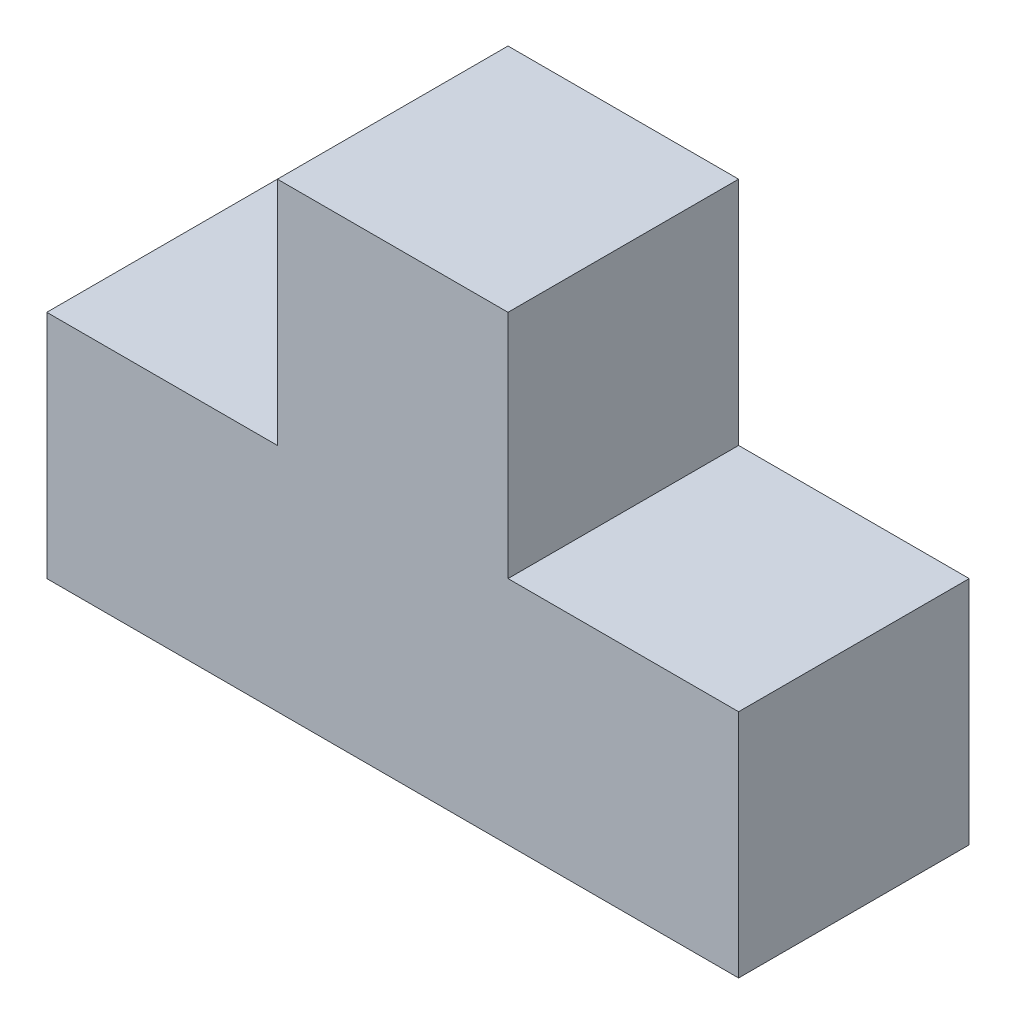
ISO-10303-21;
HEADER;
FILE_DESCRIPTION(('STEP AP214'),'2;1');
FILE_NAME('part.step','',(''),(''),'','','');
FILE_SCHEMA(('AUTOMOTIVE_DESIGN { 1 0 10303 214 1 1 1 1 }'));
ENDSEC;
DATA;
#1=APPLICATION_CONTEXT('core data for automotive mechanical design processes');
#2=APPLICATION_PROTOCOL_DEFINITION('international standard','automotive_design',2000,#1);
#3=PRODUCT_CONTEXT('',#1,'mechanical');
#4=PRODUCT('Part','Part','',(#3));
#5=PRODUCT_RELATED_PRODUCT_CATEGORY('part','',(#4));
#6=PRODUCT_DEFINITION_FORMATION('','',#4);
#7=PRODUCT_DEFINITION_CONTEXT('part definition',#1,'design');
#8=PRODUCT_DEFINITION('design','',#6,#7);
#9=PRODUCT_DEFINITION_SHAPE('','',#8);
#10=(LENGTH_UNIT() NAMED_UNIT(*) SI_UNIT(.MILLI.,.METRE.));
#11=(NAMED_UNIT(*) PLANE_ANGLE_UNIT() SI_UNIT($,.RADIAN.));
#12=(NAMED_UNIT(*) SI_UNIT($,.STERADIAN.) SOLID_ANGLE_UNIT());
#13=UNCERTAINTY_MEASURE_WITH_UNIT(LENGTH_MEASURE(1.E-05),#10,'distance_accuracy_value','');
#14=(GEOMETRIC_REPRESENTATION_CONTEXT(3) GLOBAL_UNCERTAINTY_ASSIGNED_CONTEXT((#13)) GLOBAL_UNIT_ASSIGNED_CONTEXT((#10,
#11,#12)) REPRESENTATION_CONTEXT('',''));
#15=CARTESIAN_POINT('',(0.,0.,0.));
#16=DIRECTION('',(0.,0.,1.));
#17=DIRECTION('',(1.,0.,0.));
#18=AXIS2_PLACEMENT_3D('',#15,#16,#17);
#19=CARTESIAN_POINT('',(45.,30.,-30.));
#20=DIRECTION('',(0.,1.,0.));
#21=DIRECTION('',(-1.,0.,0.));
#22=AXIS2_PLACEMENT_3D('',#19,#20,#21);
#23=PLANE('',#22);
#24=DIRECTION('',(-1.,0.,0.));
#25=VECTOR('',#24,1.);
#26=CARTESIAN_POINT('',(45.,30.,0.));
#27=LINE('',#26,#25);
#28=CARTESIAN_POINT('',(45.,30.,0.));
#29=VERTEX_POINT('',#28);
#30=CARTESIAN_POINT('',(15.,30.,0.));
#31=VERTEX_POINT('',#30);
#32=EDGE_CURVE('E130',#29,#31,#27,.T.);
#33=ORIENTED_EDGE('',*,*,#32,.F.);
#34=DIRECTION('',(0.,0.,1.));
#35=VECTOR('',#34,1.);
#36=CARTESIAN_POINT('',(45.,30.,-30.));
#37=LINE('',#36,#35);
#38=CARTESIAN_POINT('',(45.,30.,-30.));
#39=VERTEX_POINT('',#38);
#40=EDGE_CURVE('E11',#39,#29,#37,.T.);
#41=ORIENTED_EDGE('',*,*,#40,.F.);
#42=DIRECTION('',(-1.,0.,0.));
#43=VECTOR('',#42,1.);
#44=CARTESIAN_POINT('',(45.,30.,-30.));
#45=LINE('',#44,#43);
#46=CARTESIAN_POINT('',(15.,30.,-30.));
#47=VERTEX_POINT('',#46);
#48=EDGE_CURVE('E150',#39,#47,#45,.T.);
#49=ORIENTED_EDGE('',*,*,#48,.T.);
#50=DIRECTION('',(0.,0.,1.));
#51=VECTOR('',#50,1.);
#52=CARTESIAN_POINT('',(15.,30.,-30.));
#53=LINE('',#52,#51);
#54=EDGE_CURVE('E36',#47,#31,#53,.T.);
#55=ORIENTED_EDGE('',*,*,#54,.T.);
#56=EDGE_LOOP('',(#33,#41,#49,#55));
#57=FACE_BOUND('',#56,.T.);
#58=ADVANCED_FACE('F33',(#57),#23,.T.);
#59=CARTESIAN_POINT('',(45.,0.,-30.));
#60=DIRECTION('',(1.,0.,0.));
#61=DIRECTION('',(0.,1.,0.));
#62=AXIS2_PLACEMENT_3D('',#59,#60,#61);
#63=PLANE('',#62);
#64=DIRECTION('',(0.,1.,0.));
#65=VECTOR('',#64,1.);
#66=CARTESIAN_POINT('',(45.,0.,0.));
#67=LINE('',#66,#65);
#68=CARTESIAN_POINT('',(45.,0.,0.));
#69=VERTEX_POINT('',#68);
#70=EDGE_CURVE('E148',#69,#29,#67,.T.);
#71=ORIENTED_EDGE('',*,*,#70,.F.);
#72=DIRECTION('',(0.,0.,1.));
#73=VECTOR('',#72,1.);
#74=CARTESIAN_POINT('',(45.,0.,-30.));
#75=LINE('',#74,#73);
#76=CARTESIAN_POINT('',(45.,0.,-30.));
#77=VERTEX_POINT('',#76);
#78=EDGE_CURVE('E42',#77,#69,#75,.T.);
#79=ORIENTED_EDGE('',*,*,#78,.F.);
#80=DIRECTION('',(0.,1.,0.));
#81=VECTOR('',#80,1.);
#82=CARTESIAN_POINT('',(45.,0.,-30.));
#83=LINE('',#82,#81);
#84=EDGE_CURVE('E120',#77,#39,#83,.T.);
#85=ORIENTED_EDGE('',*,*,#84,.T.);
#86=ORIENTED_EDGE('',*,*,#40,.T.);
#87=EDGE_LOOP('',(#71,#79,#85,#86));
#88=FACE_BOUND('',#87,.T.);
#89=ADVANCED_FACE('F162',(#88),#63,.T.);
#90=CARTESIAN_POINT('',(-45.,0.,-30.));
#91=DIRECTION('',(0.,-1.,0.));
#92=DIRECTION('',(1.,0.,0.));
#93=AXIS2_PLACEMENT_3D('',#90,#91,#92);
#94=PLANE('',#93);
#95=DIRECTION('',(1.,0.,0.));
#96=VECTOR('',#95,1.);
#97=CARTESIAN_POINT('',(-45.,0.,0.));
#98=LINE('',#97,#96);
#99=CARTESIAN_POINT('',(-45.,0.,0.));
#100=VERTEX_POINT('',#99);
#101=EDGE_CURVE('E107',#100,#69,#98,.T.);
#102=ORIENTED_EDGE('',*,*,#101,.F.);
#103=DIRECTION('',(0.,0.,1.));
#104=VECTOR('',#103,1.);
#105=CARTESIAN_POINT('',(-45.,0.,-30.));
#106=LINE('',#105,#104);
#107=CARTESIAN_POINT('',(-45.,0.,-30.));
#108=VERTEX_POINT('',#107);
#109=EDGE_CURVE('E102',#108,#100,#106,.T.);
#110=ORIENTED_EDGE('',*,*,#109,.F.);
#111=DIRECTION('',(1.,0.,0.));
#112=VECTOR('',#111,1.);
#113=CARTESIAN_POINT('',(-45.,0.,-30.));
#114=LINE('',#113,#112);
#115=EDGE_CURVE('E105',#108,#77,#114,.T.);
#116=ORIENTED_EDGE('',*,*,#115,.T.);
#117=ORIENTED_EDGE('',*,*,#78,.T.);
#118=EDGE_LOOP('',(#102,#110,#116,#117));
#119=FACE_BOUND('',#118,.T.);
#120=ADVANCED_FACE('F104',(#119),#94,.T.);
#121=CARTESIAN_POINT('',(-45.,30.,-30.));
#122=DIRECTION('',(-1.,0.,0.));
#123=DIRECTION('',(0.,-1.,0.));
#124=AXIS2_PLACEMENT_3D('',#121,#122,#123);
#125=PLANE('',#124);
#126=DIRECTION('',(0.,-1.,0.));
#127=VECTOR('',#126,1.);
#128=CARTESIAN_POINT('',(-45.,30.,0.));
#129=LINE('',#128,#127);
#130=CARTESIAN_POINT('',(-45.,30.,0.));
#131=VERTEX_POINT('',#130);
#132=EDGE_CURVE('E145',#131,#100,#129,.T.);
#133=ORIENTED_EDGE('',*,*,#132,.F.);
#134=DIRECTION('',(0.,0.,1.));
#135=VECTOR('',#134,1.);
#136=CARTESIAN_POINT('',(-45.,30.,-30.));
#137=LINE('',#136,#135);
#138=CARTESIAN_POINT('',(-45.,30.,-30.));
#139=VERTEX_POINT('',#138);
#140=EDGE_CURVE('E112',#139,#131,#137,.T.);
#141=ORIENTED_EDGE('',*,*,#140,.F.);
#142=DIRECTION('',(0.,-1.,0.));
#143=VECTOR('',#142,1.);
#144=CARTESIAN_POINT('',(-45.,30.,-30.));
#145=LINE('',#144,#143);
#146=EDGE_CURVE('E118',#139,#108,#145,.T.);
#147=ORIENTED_EDGE('',*,*,#146,.T.);
#148=ORIENTED_EDGE('',*,*,#109,.T.);
#149=EDGE_LOOP('',(#133,#141,#147,#148));
#150=FACE_BOUND('',#149,.T.);
#151=ADVANCED_FACE('F122',(#150),#125,.T.);
#152=CARTESIAN_POINT('',(-15.,30.,-30.));
#153=DIRECTION('',(0.,1.,0.));
#154=DIRECTION('',(-1.,0.,0.));
#155=AXIS2_PLACEMENT_3D('',#152,#153,#154);
#156=PLANE('',#155);
#157=DIRECTION('',(-1.,0.,0.));
#158=VECTOR('',#157,1.);
#159=CARTESIAN_POINT('',(-15.,30.,0.));
#160=LINE('',#159,#158);
#161=CARTESIAN_POINT('',(-15.,30.,0.));
#162=VERTEX_POINT('',#161);
#163=EDGE_CURVE('E142',#162,#131,#160,.T.);
#164=ORIENTED_EDGE('',*,*,#163,.F.);
#165=DIRECTION('',(0.,0.,1.));
#166=VECTOR('',#165,1.);
#167=CARTESIAN_POINT('',(-15.,30.,-30.));
#168=LINE('',#167,#166);
#169=CARTESIAN_POINT('',(-15.,30.,-30.));
#170=VERTEX_POINT('',#169);
#171=EDGE_CURVE('E154',#170,#162,#168,.T.);
#172=ORIENTED_EDGE('',*,*,#171,.F.);
#173=DIRECTION('',(-1.,0.,0.));
#174=VECTOR('',#173,1.);
#175=CARTESIAN_POINT('',(-15.,30.,-30.));
#176=LINE('',#175,#174);
#177=EDGE_CURVE('E123',#170,#139,#176,.T.);
#178=ORIENTED_EDGE('',*,*,#177,.T.);
#179=ORIENTED_EDGE('',*,*,#140,.T.);
#180=EDGE_LOOP('',(#164,#172,#178,#179));
#181=FACE_BOUND('',#180,.T.);
#182=ADVANCED_FACE('F175',(#181),#156,.T.);
#183=CARTESIAN_POINT('',(-15.,60.,-30.));
#184=DIRECTION('',(-1.,0.,0.));
#185=DIRECTION('',(0.,-1.,0.));
#186=AXIS2_PLACEMENT_3D('',#183,#184,#185);
#187=PLANE('',#186);
#188=DIRECTION('',(0.,-1.,0.));
#189=VECTOR('',#188,1.);
#190=CARTESIAN_POINT('',(-15.,60.,0.));
#191=LINE('',#190,#189);
#192=CARTESIAN_POINT('',(-15.,60.,0.));
#193=VERTEX_POINT('',#192);
#194=EDGE_CURVE('E139',#193,#162,#191,.T.);
#195=ORIENTED_EDGE('',*,*,#194,.F.);
#196=DIRECTION('',(0.,0.,1.));
#197=VECTOR('',#196,1.);
#198=CARTESIAN_POINT('',(-15.,60.,-30.));
#199=LINE('',#198,#197);
#200=CARTESIAN_POINT('',(-15.,60.,-30.));
#201=VERTEX_POINT('',#200);
#202=EDGE_CURVE('E156',#201,#193,#199,.T.);
#203=ORIENTED_EDGE('',*,*,#202,.F.);
#204=DIRECTION('',(0.,-1.,0.));
#205=VECTOR('',#204,1.);
#206=CARTESIAN_POINT('',(-15.,60.,-30.));
#207=LINE('',#206,#205);
#208=EDGE_CURVE('E125',#201,#170,#207,.T.);
#209=ORIENTED_EDGE('',*,*,#208,.T.);
#210=ORIENTED_EDGE('',*,*,#171,.T.);
#211=EDGE_LOOP('',(#195,#203,#209,#210));
#212=FACE_BOUND('',#211,.T.);
#213=ADVANCED_FACE('F178',(#212),#187,.T.);
#214=CARTESIAN_POINT('',(15.,60.,-30.));
#215=DIRECTION('',(0.,1.,0.));
#216=DIRECTION('',(-1.,0.,0.));
#217=AXIS2_PLACEMENT_3D('',#214,#215,#216);
#218=PLANE('',#217);
#219=DIRECTION('',(-1.,0.,0.));
#220=VECTOR('',#219,1.);
#221=CARTESIAN_POINT('',(15.,60.,0.));
#222=LINE('',#221,#220);
#223=CARTESIAN_POINT('',(15.,60.,0.));
#224=VERTEX_POINT('',#223);
#225=EDGE_CURVE('E136',#224,#193,#222,.T.);
#226=ORIENTED_EDGE('',*,*,#225,.F.);
#227=DIRECTION('',(0.,0.,1.));
#228=VECTOR('',#227,1.);
#229=CARTESIAN_POINT('',(15.,60.,-30.));
#230=LINE('',#229,#228);
#231=CARTESIAN_POINT('',(15.,60.,-30.));
#232=VERTEX_POINT('',#231);
#233=EDGE_CURVE('E157',#232,#224,#230,.T.);
#234=ORIENTED_EDGE('',*,*,#233,.F.);
#235=DIRECTION('',(-1.,0.,0.));
#236=VECTOR('',#235,1.);
#237=CARTESIAN_POINT('',(15.,60.,-30.));
#238=LINE('',#237,#236);
#239=EDGE_CURVE('E253',#232,#201,#238,.T.);
#240=ORIENTED_EDGE('',*,*,#239,.T.);
#241=ORIENTED_EDGE('',*,*,#202,.T.);
#242=EDGE_LOOP('',(#226,#234,#240,#241));
#243=FACE_BOUND('',#242,.T.);
#244=ADVANCED_FACE('F182',(#243),#218,.T.);
#245=CARTESIAN_POINT('',(15.,30.,-30.));
#246=DIRECTION('',(1.,0.,0.));
#247=DIRECTION('',(0.,1.,0.));
#248=AXIS2_PLACEMENT_3D('',#245,#246,#247);
#249=PLANE('',#248);
#250=DIRECTION('',(0.,1.,0.));
#251=VECTOR('',#250,1.);
#252=CARTESIAN_POINT('',(15.,30.,0.));
#253=LINE('',#252,#251);
#254=EDGE_CURVE('E133',#31,#224,#253,.T.);
#255=ORIENTED_EDGE('',*,*,#254,.F.);
#256=ORIENTED_EDGE('',*,*,#54,.F.);
#257=DIRECTION('',(0.,1.,0.));
#258=VECTOR('',#257,1.);
#259=CARTESIAN_POINT('',(15.,30.,-30.));
#260=LINE('',#259,#258);
#261=EDGE_CURVE('E254',#47,#232,#260,.T.);
#262=ORIENTED_EDGE('',*,*,#261,.T.);
#263=ORIENTED_EDGE('',*,*,#233,.T.);
#264=EDGE_LOOP('',(#255,#256,#262,#263));
#265=FACE_BOUND('',#264,.T.);
#266=ADVANCED_FACE('F159',(#265),#249,.T.);
#267=CARTESIAN_POINT('',(0.,0.,-30.));
#268=DIRECTION('',(0.,0.,-1.));
#269=DIRECTION('',(-1.,0.,0.));
#270=AXIS2_PLACEMENT_3D('',#267,#268,#269);
#271=PLANE('',#270);
#272=ORIENTED_EDGE('',*,*,#48,.F.);
#273=ORIENTED_EDGE('',*,*,#84,.F.);
#274=ORIENTED_EDGE('',*,*,#115,.F.);
#275=ORIENTED_EDGE('',*,*,#146,.F.);
#276=ORIENTED_EDGE('',*,*,#177,.F.);
#277=ORIENTED_EDGE('',*,*,#208,.F.);
#278=ORIENTED_EDGE('',*,*,#239,.F.);
#279=ORIENTED_EDGE('',*,*,#261,.F.);
#280=EDGE_LOOP('',(#272,#273,#274,#275,#276,#277,#278,#279));
#281=FACE_BOUND('',#280,.T.);
#282=ADVANCED_FACE('F116',(#281),#271,.T.);
#283=CARTESIAN_POINT('',(0.,0.,0.));
#284=DIRECTION('',(0.,0.,-1.));
#285=DIRECTION('',(-1.,0.,0.));
#286=AXIS2_PLACEMENT_3D('',#283,#284,#285);
#287=PLANE('',#286);
#288=ORIENTED_EDGE('',*,*,#32,.T.);
#289=ORIENTED_EDGE('',*,*,#254,.T.);
#290=ORIENTED_EDGE('',*,*,#225,.T.);
#291=ORIENTED_EDGE('',*,*,#194,.T.);
#292=ORIENTED_EDGE('',*,*,#163,.T.);
#293=ORIENTED_EDGE('',*,*,#132,.T.);
#294=ORIENTED_EDGE('',*,*,#101,.T.);
#295=ORIENTED_EDGE('',*,*,#70,.T.);
#296=EDGE_LOOP('',(#288,#289,#290,#291,#292,#293,#294,#295));
#297=FACE_BOUND('',#296,.T.);
#298=ADVANCED_FACE('F161',(#297),#287,.F.);
#299=CLOSED_SHELL('',(#58,#89,#120,#151,#182,#213,#244,#266,#282,#298));
#300=MANIFOLD_SOLID_BREP('B2',#299);
#301=ADVANCED_BREP_SHAPE_REPRESENTATION('',(#18,#300),#14);
#302=SHAPE_DEFINITION_REPRESENTATION(#9,#301);
ENDSEC;
END-ISO-10303-21;
